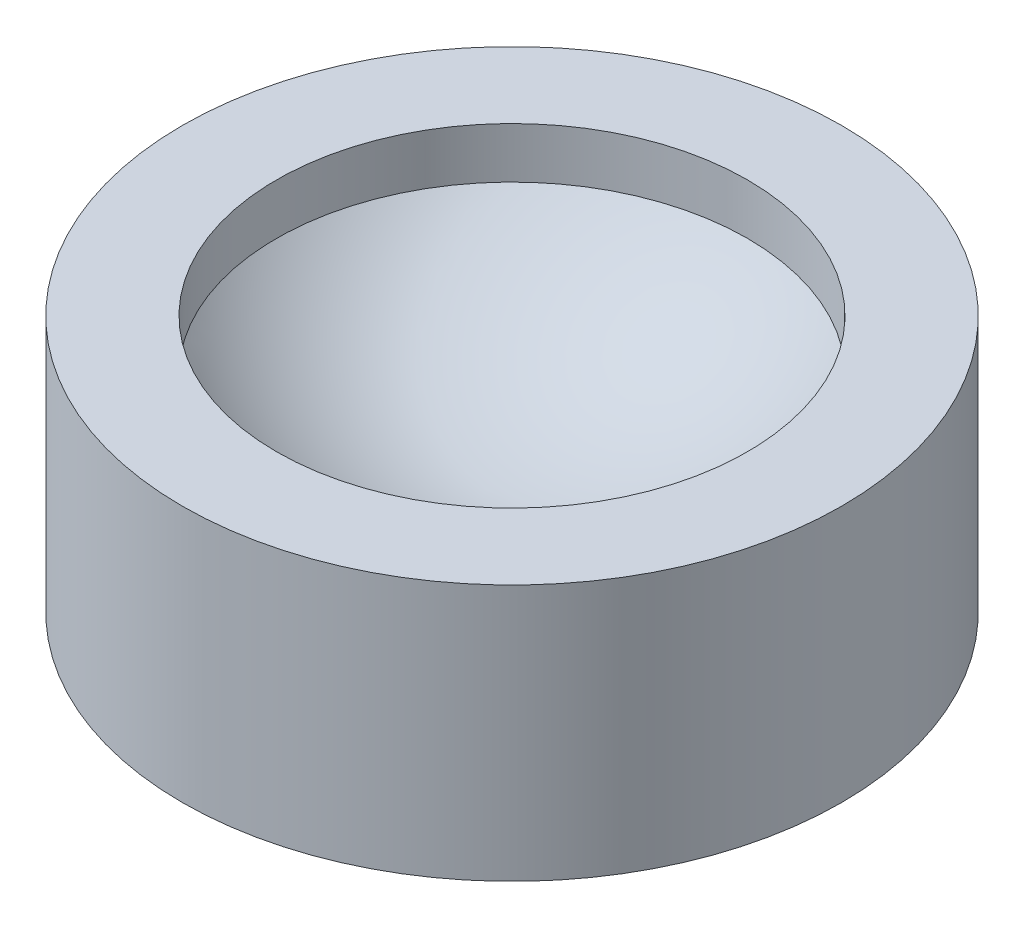
ISO-10303-21;
HEADER;
FILE_DESCRIPTION(('STEP AP214'),'2;1');
FILE_NAME('part.step','',(''),(''),'','','');
FILE_SCHEMA(('AUTOMOTIVE_DESIGN { 1 0 10303 214 1 1 1 1 }'));
ENDSEC;
DATA;
#1=APPLICATION_CONTEXT('core data for automotive mechanical design processes');
#2=APPLICATION_PROTOCOL_DEFINITION('international standard','automotive_design',2000,#1);
#3=PRODUCT_CONTEXT('',#1,'mechanical');
#4=PRODUCT('Part','Part','',(#3));
#5=PRODUCT_RELATED_PRODUCT_CATEGORY('part','',(#4));
#6=PRODUCT_DEFINITION_FORMATION('','',#4);
#7=PRODUCT_DEFINITION_CONTEXT('part definition',#1,'design');
#8=PRODUCT_DEFINITION('design','',#6,#7);
#9=PRODUCT_DEFINITION_SHAPE('','',#8);
#10=(LENGTH_UNIT() NAMED_UNIT(*) SI_UNIT(.MILLI.,.METRE.));
#11=(NAMED_UNIT(*) PLANE_ANGLE_UNIT() SI_UNIT($,.RADIAN.));
#12=(NAMED_UNIT(*) SI_UNIT($,.STERADIAN.) SOLID_ANGLE_UNIT());
#13=UNCERTAINTY_MEASURE_WITH_UNIT(LENGTH_MEASURE(1.E-05),#10,'distance_accuracy_value','');
#14=(GEOMETRIC_REPRESENTATION_CONTEXT(3) GLOBAL_UNCERTAINTY_ASSIGNED_CONTEXT((#13)) GLOBAL_UNIT_ASSIGNED_CONTEXT((#10,
#11,#12)) REPRESENTATION_CONTEXT('',''));
#15=CARTESIAN_POINT('',(0.,0.,0.));
#16=DIRECTION('',(0.,0.,1.));
#17=DIRECTION('',(1.,0.,0.));
#18=AXIS2_PLACEMENT_3D('',#15,#16,#17);
#19=CARTESIAN_POINT('',(0.,8.174080160432,0.));
#20=DIRECTION('',(0.,-1.,0.));
#21=DIRECTION('',(0.,0.,-1.));
#22=AXIS2_PLACEMENT_3D('',#19,#20,#21);
#23=CYLINDRICAL_SURFACE('',#22,10.5);
#24=CARTESIAN_POINT('',(0.,8.174080160432,0.));
#25=DIRECTION('',(0.,1.,0.));
#26=DIRECTION('',(0.,0.,1.));
#27=AXIS2_PLACEMENT_3D('',#24,#25,#26);
#28=CIRCLE('',#27,10.5);
#29=CARTESIAN_POINT('',(0.,8.174080160432,10.5));
#30=VERTEX_POINT('',#29);
#31=EDGE_CURVE('E10',#30,#30,#28,.T.);
#32=ORIENTED_EDGE('',*,*,#31,.F.);
#33=EDGE_LOOP('',(#32));
#34=FACE_BOUND('',#33,.T.);
#35=CARTESIAN_POINT('',(0.,0.,0.));
#36=DIRECTION('',(0.,1.,0.));
#37=DIRECTION('',(0.,0.,1.));
#38=AXIS2_PLACEMENT_3D('',#35,#36,#37);
#39=CIRCLE('',#38,10.5);
#40=CARTESIAN_POINT('',(0.,0.,10.5));
#41=VERTEX_POINT('',#40);
#42=EDGE_CURVE('E39',#41,#41,#39,.T.);
#43=ORIENTED_EDGE('',*,*,#42,.T.);
#44=EDGE_LOOP('',(#43));
#45=FACE_BOUND('',#44,.T.);
#46=ADVANCED_FACE('F36',(#34,#45),#23,.T.);
#47=CARTESIAN_POINT('',(0.,8.174080160432,0.));
#48=DIRECTION('',(0.,1.,0.));
#49=DIRECTION('',(0.,0.,1.));
#50=AXIS2_PLACEMENT_3D('',#47,#48,#49);
#51=PLANE('',#50);
#52=CARTESIAN_POINT('',(0.,8.174080160432,0.));
#53=DIRECTION('',(0.,-1.,0.));
#54=DIRECTION('',(0.,0.,-1.));
#55=AXIS2_PLACEMENT_3D('',#52,#53,#54);
#56=CIRCLE('',#55,7.5);
#57=CARTESIAN_POINT('',(0.,8.174080160432,-7.5));
#58=VERTEX_POINT('',#57);
#59=EDGE_CURVE('E53',#58,#58,#56,.T.);
#60=ORIENTED_EDGE('',*,*,#59,.T.);
#61=EDGE_LOOP('',(#60));
#62=FACE_BOUND('',#61,.T.);
#63=ORIENTED_EDGE('',*,*,#31,.T.);
#64=EDGE_LOOP('',(#63));
#65=FACE_BOUND('',#64,.T.);
#66=ADVANCED_FACE('F58',(#62,#65),#51,.T.);
#67=CARTESIAN_POINT('',(0.,0.,0.));
#68=DIRECTION('',(0.,1.,0.));
#69=DIRECTION('',(0.,0.,1.));
#70=AXIS2_PLACEMENT_3D('',#67,#68,#69);
#71=PLANE('',#70);
#72=ORIENTED_EDGE('',*,*,#42,.F.);
#73=EDGE_LOOP('',(#72));
#74=FACE_BOUND('',#73,.T.);
#75=ADVANCED_FACE('F68',(#74),#71,.F.);
#76=CARTESIAN_POINT('',(0.,13.174080160432,0.));
#77=DIRECTION('',(0.,-1.,0.));
#78=DIRECTION('',(0.,0.,-1.));
#79=AXIS2_PLACEMENT_3D('',#76,#77,#78);
#80=SPHERICAL_SURFACE('',#79,10.);
#81=CARTESIAN_POINT('',(0.,6.55970188277052,0.));
#82=DIRECTION('',(0.,-1.,0.));
#83=DIRECTION('',(0.,0.,-1.));
#84=AXIS2_PLACEMENT_3D('',#81,#82,#83);
#85=CIRCLE('',#84,7.5);
#86=CARTESIAN_POINT('',(0.,6.55970188277052,-7.5));
#87=VERTEX_POINT('',#86);
#88=EDGE_CURVE('E48',#87,#87,#85,.T.);
#89=ORIENTED_EDGE('',*,*,#88,.F.);
#90=EDGE_LOOP('',(#89));
#91=FACE_BOUND('',#90,.T.);
#92=ADVANCED_FACE('F63',(#91),#80,.F.);
#93=CARTESIAN_POINT('',(0.,0.0490987680048355,0.));
#94=DIRECTION('',(0.,-1.,0.));
#95=DIRECTION('',(0.,0.,-1.));
#96=AXIS2_PLACEMENT_3D('',#93,#94,#95);
#97=CYLINDRICAL_SURFACE('',#96,7.5);
#98=ORIENTED_EDGE('',*,*,#59,.F.);
#99=EDGE_LOOP('',(#98));
#100=FACE_BOUND('',#99,.T.);
#101=ORIENTED_EDGE('',*,*,#88,.T.);
#102=EDGE_LOOP('',(#101));
#103=FACE_BOUND('',#102,.T.);
#104=ADVANCED_FACE('F60',(#100,#103),#97,.F.);
#105=CLOSED_SHELL('',(#46,#66,#75,#92,#104));
#106=MANIFOLD_SOLID_BREP('B2',#105);
#107=ADVANCED_BREP_SHAPE_REPRESENTATION('',(#18,#106),#14);
#108=SHAPE_DEFINITION_REPRESENTATION(#9,#107);
ENDSEC;
END-ISO-10303-21;
